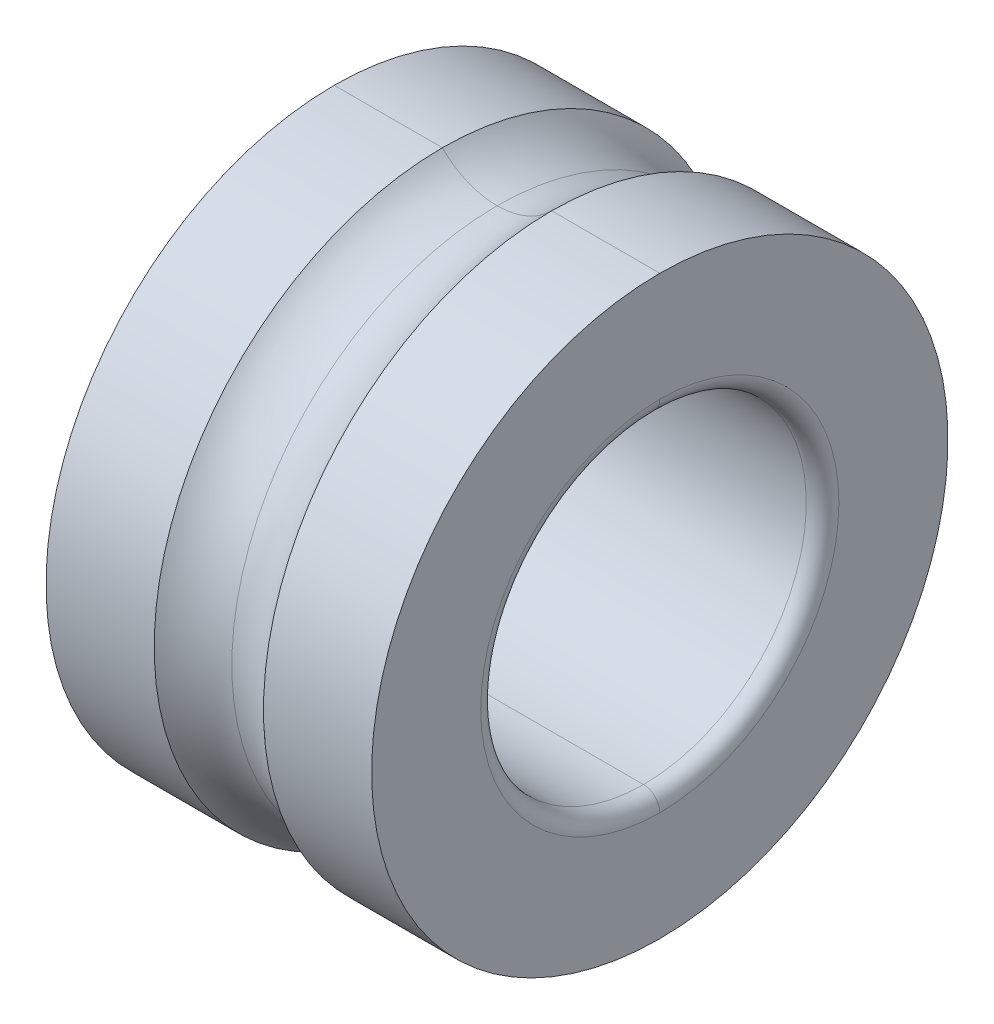
ISO-10303-21;
HEADER;
FILE_DESCRIPTION(('STEP AP214'),'2;1');
FILE_NAME('part.step','',(''),(''),'','','');
FILE_SCHEMA(('AUTOMOTIVE_DESIGN { 1 0 10303 214 1 1 1 1 }'));
ENDSEC;
DATA;
#1=APPLICATION_CONTEXT('core data for automotive mechanical design processes');
#2=APPLICATION_PROTOCOL_DEFINITION('international standard','automotive_design',2000,#1);
#3=PRODUCT_CONTEXT('',#1,'mechanical');
#4=PRODUCT('Part','Part','',(#3));
#5=PRODUCT_RELATED_PRODUCT_CATEGORY('part','',(#4));
#6=PRODUCT_DEFINITION_FORMATION('','',#4);
#7=PRODUCT_DEFINITION_CONTEXT('part definition',#1,'design');
#8=PRODUCT_DEFINITION('design','',#6,#7);
#9=PRODUCT_DEFINITION_SHAPE('','',#8);
#10=(LENGTH_UNIT() NAMED_UNIT(*) SI_UNIT(.MILLI.,.METRE.));
#11=(NAMED_UNIT(*) PLANE_ANGLE_UNIT() SI_UNIT($,.RADIAN.));
#12=(NAMED_UNIT(*) SI_UNIT($,.STERADIAN.) SOLID_ANGLE_UNIT());
#13=UNCERTAINTY_MEASURE_WITH_UNIT(LENGTH_MEASURE(1.E-05),#10,'distance_accuracy_value','');
#14=(GEOMETRIC_REPRESENTATION_CONTEXT(3) GLOBAL_UNCERTAINTY_ASSIGNED_CONTEXT((#13)) GLOBAL_UNIT_ASSIGNED_CONTEXT((#10,
#11,#12)) REPRESENTATION_CONTEXT('',''));
#15=CARTESIAN_POINT('',(0.,0.,0.));
#16=DIRECTION('',(0.,0.,1.));
#17=DIRECTION('',(1.,0.,0.));
#18=AXIS2_PLACEMENT_3D('',#15,#16,#17);
#19=CARTESIAN_POINT('',(-2.25171,0.,0.));
#20=DIRECTION('',(1.,0.,0.));
#21=DIRECTION('',(0.,-1.,0.));
#22=AXIS2_PLACEMENT_3D('',#19,#20,#21);
#23=TOROIDAL_SURFACE('',#22,2.75209,0.25019);
#24=CARTESIAN_POINT('',(-2.5019,0.,0.));
#25=DIRECTION('',(-1.,0.,0.));
#26=DIRECTION('',(0.,1.,0.));
#27=AXIS2_PLACEMENT_3D('',#24,#25,#26);
#28=CIRCLE('',#27,2.75209);
#29=CARTESIAN_POINT('',(-2.5019,2.75209,0.));
#30=VERTEX_POINT('',#29);
#31=CARTESIAN_POINT('',(-2.5019,-2.75209,0.));
#32=VERTEX_POINT('',#31);
#33=EDGE_CURVE('E197',#30,#32,#28,.T.);
#34=ORIENTED_EDGE('',*,*,#33,.T.);
#35=CARTESIAN_POINT('',(-2.25171,-2.75209,0.));
#36=DIRECTION('',(0.,0.,-1.));
#37=DIRECTION('',(-1.,0.,0.));
#38=AXIS2_PLACEMENT_3D('',#35,#36,#37);
#39=CIRCLE('',#38,0.25019);
#40=CARTESIAN_POINT('',(-2.25171,-2.5019,0.));
#41=VERTEX_POINT('',#40);
#42=EDGE_CURVE('E27',#32,#41,#39,.T.);
#43=ORIENTED_EDGE('',*,*,#42,.T.);
#44=CARTESIAN_POINT('',(-2.25171,0.,0.));
#45=DIRECTION('',(-1.,0.,0.));
#46=DIRECTION('',(0.,1.,0.));
#47=AXIS2_PLACEMENT_3D('',#44,#45,#46);
#48=CIRCLE('',#47,2.5019);
#49=CARTESIAN_POINT('',(-2.25171,2.5019,0.));
#50=VERTEX_POINT('',#49);
#51=EDGE_CURVE('E164',#50,#41,#48,.T.);
#52=ORIENTED_EDGE('',*,*,#51,.F.);
#53=CARTESIAN_POINT('',(-2.25171,2.75209,0.));
#54=DIRECTION('',(0.,0.,1.));
#55=DIRECTION('',(-1.,0.,0.));
#56=AXIS2_PLACEMENT_3D('',#53,#54,#55);
#57=CIRCLE('',#56,0.25019);
#58=EDGE_CURVE('E11',#30,#50,#57,.T.);
#59=ORIENTED_EDGE('',*,*,#58,.F.);
#60=EDGE_LOOP('',(#34,#43,#52,#59));
#61=FACE_BOUND('',#60,.T.);
#62=ADVANCED_FACE('F16',(#61),#23,.T.);
#63=CARTESIAN_POINT('',(-2.25171,0.,0.));
#64=DIRECTION('',(1.,0.,0.));
#65=DIRECTION('',(0.,-1.,0.));
#66=AXIS2_PLACEMENT_3D('',#63,#64,#65);
#67=TOROIDAL_SURFACE('',#66,2.75209,0.25019);
#68=CARTESIAN_POINT('',(-2.25171,0.,0.));
#69=DIRECTION('',(1.,0.,0.));
#70=DIRECTION('',(0.,1.,0.));
#71=AXIS2_PLACEMENT_3D('',#68,#69,#70);
#72=CIRCLE('',#71,2.5019);
#73=EDGE_CURVE('E200',#50,#41,#72,.T.);
#74=ORIENTED_EDGE('',*,*,#73,.T.);
#75=ORIENTED_EDGE('',*,*,#42,.F.);
#76=CARTESIAN_POINT('',(-2.5019,0.,0.));
#77=DIRECTION('',(1.,0.,0.));
#78=DIRECTION('',(0.,1.,0.));
#79=AXIS2_PLACEMENT_3D('',#76,#77,#78);
#80=CIRCLE('',#79,2.75209);
#81=EDGE_CURVE('E216',#30,#32,#80,.T.);
#82=ORIENTED_EDGE('',*,*,#81,.F.);
#83=ORIENTED_EDGE('',*,*,#58,.T.);
#84=EDGE_LOOP('',(#74,#75,#82,#83));
#85=FACE_BOUND('',#84,.T.);
#86=ADVANCED_FACE('F293',(#85),#67,.T.);
#87=CARTESIAN_POINT('',(-2.5019,0.,0.));
#88=DIRECTION('',(1.,0.,0.));
#89=DIRECTION('',(0.,1.,0.));
#90=AXIS2_PLACEMENT_3D('',#87,#88,#89);
#91=PLANE('',#90);
#92=ORIENTED_EDGE('',*,*,#33,.F.);
#93=ORIENTED_EDGE('',*,*,#81,.T.);
#94=EDGE_LOOP('',(#92,#93));
#95=FACE_BOUND('',#94,.T.);
#96=CARTESIAN_POINT('',(-2.5019,0.,0.));
#97=DIRECTION('',(1.,0.,0.));
#98=DIRECTION('',(0.,1.,0.));
#99=AXIS2_PLACEMENT_3D('',#96,#97,#98);
#100=CIRCLE('',#99,4.4283249);
#101=CARTESIAN_POINT('',(-2.5019,4.4283249,0.));
#102=VERTEX_POINT('',#101);
#103=CARTESIAN_POINT('',(-2.5019,-4.4283249,0.));
#104=VERTEX_POINT('',#103);
#105=EDGE_CURVE('E109',#102,#104,#100,.T.);
#106=ORIENTED_EDGE('',*,*,#105,.F.);
#107=CARTESIAN_POINT('',(-2.5019,0.,0.));
#108=DIRECTION('',(-1.,0.,0.));
#109=DIRECTION('',(0.,1.,0.));
#110=AXIS2_PLACEMENT_3D('',#107,#108,#109);
#111=CIRCLE('',#110,4.4283249);
#112=EDGE_CURVE('E193',#102,#104,#111,.T.);
#113=ORIENTED_EDGE('',*,*,#112,.T.);
#114=EDGE_LOOP('',(#106,#113));
#115=FACE_BOUND('',#114,.T.);
#116=ADVANCED_FACE('F288',(#95,#115),#91,.F.);
#117=CARTESIAN_POINT('',(-2.75209,0.,0.));
#118=DIRECTION('',(1.,0.,0.));
#119=DIRECTION('',(0.,-1.,0.));
#120=AXIS2_PLACEMENT_3D('',#117,#118,#119);
#121=CYLINDRICAL_SURFACE('',#120,4.4283249);
#122=CARTESIAN_POINT('',(-0.839755569912454,0.,0.));
#123=DIRECTION('',(-1.,0.,0.));
#124=DIRECTION('',(0.,1.,0.));
#125=AXIS2_PLACEMENT_3D('',#122,#123,#124);
#126=CIRCLE('',#125,4.4283249);
#127=CARTESIAN_POINT('',(-0.839755569912454,4.4283249,0.));
#128=VERTEX_POINT('',#127);
#129=CARTESIAN_POINT('',(-0.839755569912454,-4.4283249,0.));
#130=VERTEX_POINT('',#129);
#131=EDGE_CURVE('E127',#128,#130,#126,.T.);
#132=ORIENTED_EDGE('',*,*,#131,.T.);
#133=DIRECTION('',(-1.,0.,0.));
#134=VECTOR('',#133,1.);
#135=CARTESIAN_POINT('',(-0.839755569912453,-4.4283249,0.));
#136=LINE('',#135,#134);
#137=EDGE_CURVE('E102',#130,#104,#136,.T.);
#138=ORIENTED_EDGE('',*,*,#137,.T.);
#139=ORIENTED_EDGE('',*,*,#112,.F.);
#140=DIRECTION('',(-1.,0.,0.));
#141=VECTOR('',#140,1.);
#142=CARTESIAN_POINT('',(-0.839755569912453,4.4283249,0.));
#143=LINE('',#142,#141);
#144=EDGE_CURVE('E114',#128,#102,#143,.T.);
#145=ORIENTED_EDGE('',*,*,#144,.F.);
#146=EDGE_LOOP('',(#132,#138,#139,#145));
#147=FACE_BOUND('',#146,.T.);
#148=ADVANCED_FACE('F128',(#147),#121,.T.);
#149=CARTESIAN_POINT('',(-2.75209,0.,0.));
#150=DIRECTION('',(1.,0.,0.));
#151=DIRECTION('',(0.,-1.,0.));
#152=AXIS2_PLACEMENT_3D('',#149,#150,#151);
#153=CYLINDRICAL_SURFACE('',#152,4.4283249);
#154=ORIENTED_EDGE('',*,*,#105,.T.);
#155=ORIENTED_EDGE('',*,*,#137,.F.);
#156=CARTESIAN_POINT('',(-0.839755569912454,0.,0.));
#157=DIRECTION('',(1.,0.,0.));
#158=DIRECTION('',(0.,1.,0.));
#159=AXIS2_PLACEMENT_3D('',#156,#157,#158);
#160=CIRCLE('',#159,4.4283249);
#161=EDGE_CURVE('E106',#128,#130,#160,.T.);
#162=ORIENTED_EDGE('',*,*,#161,.F.);
#163=ORIENTED_EDGE('',*,*,#144,.T.);
#164=EDGE_LOOP('',(#154,#155,#162,#163));
#165=FACE_BOUND('',#164,.T.);
#166=ADVANCED_FACE('F104',(#165),#153,.T.);
#167=CARTESIAN_POINT('',(0.,0.,0.));
#168=DIRECTION('',(1.,0.,0.));
#169=DIRECTION('',(0.,-1.,0.));
#170=AXIS2_PLACEMENT_3D('',#167,#168,#169);
#171=TOROIDAL_SURFACE('',#170,5.25145,1.175893);
#172=CARTESIAN_POINT('',(0.,0.,0.));
#173=DIRECTION('',(1.,0.,0.));
#174=DIRECTION('',(0.,0.,-1.));
#175=AXIS2_PLACEMENT_3D('',#172,#173,#174);
#176=CIRCLE('',#175,4.075557);
#177=CARTESIAN_POINT('',(0.,4.075557,0.));
#178=VERTEX_POINT('',#177);
#179=CARTESIAN_POINT('',(0.,-4.075557,0.));
#180=VERTEX_POINT('',#179);
#181=EDGE_CURVE('E183',#178,#180,#176,.T.);
#182=ORIENTED_EDGE('',*,*,#181,.F.);
#183=CARTESIAN_POINT('',(0.,5.25145,0.));
#184=DIRECTION('',(0.,0.,-1.));
#185=DIRECTION('',(0.714142842854285,-0.7,0.));
#186=AXIS2_PLACEMENT_3D('',#183,#184,#185);
#187=CIRCLE('',#186,1.175893);
#188=EDGE_CURVE('E123',#178,#128,#187,.T.);
#189=ORIENTED_EDGE('',*,*,#188,.T.);
#190=ORIENTED_EDGE('',*,*,#161,.T.);
#191=CARTESIAN_POINT('',(0.,-5.25145,0.));
#192=DIRECTION('',(0.,0.,1.));
#193=DIRECTION('',(0.714142842854285,0.7,0.));
#194=AXIS2_PLACEMENT_3D('',#191,#192,#193);
#195=CIRCLE('',#194,1.175893);
#196=EDGE_CURVE('E121',#180,#130,#195,.T.);
#197=ORIENTED_EDGE('',*,*,#196,.F.);
#198=EDGE_LOOP('',(#182,#189,#190,#197));
#199=FACE_BOUND('',#198,.T.);
#200=ADVANCED_FACE('F119',(#199),#171,.F.);
#201=CARTESIAN_POINT('',(0.,0.,0.));
#202=DIRECTION('',(1.,0.,0.));
#203=DIRECTION('',(0.,-1.,0.));
#204=AXIS2_PLACEMENT_3D('',#201,#202,#203);
#205=TOROIDAL_SURFACE('',#204,5.25145,1.175893);
#206=CARTESIAN_POINT('',(0.,0.,0.));
#207=DIRECTION('',(1.,0.,0.));
#208=DIRECTION('',(0.,0.,-1.));
#209=AXIS2_PLACEMENT_3D('',#206,#207,#208);
#210=CIRCLE('',#209,4.075557);
#211=EDGE_CURVE('E134',#180,#178,#210,.T.);
#212=ORIENTED_EDGE('',*,*,#211,.F.);
#213=ORIENTED_EDGE('',*,*,#196,.T.);
#214=ORIENTED_EDGE('',*,*,#131,.F.);
#215=ORIENTED_EDGE('',*,*,#188,.F.);
#216=EDGE_LOOP('',(#212,#213,#214,#215));
#217=FACE_BOUND('',#216,.T.);
#218=ADVANCED_FACE('F132',(#217),#205,.F.);
#219=CARTESIAN_POINT('',(-2.75209,0.,0.));
#220=DIRECTION('',(1.,0.,0.));
#221=DIRECTION('',(0.,-1.,0.));
#222=AXIS2_PLACEMENT_3D('',#219,#220,#221);
#223=CYLINDRICAL_SURFACE('',#222,4.4283249);
#224=CARTESIAN_POINT('',(2.5019,0.,0.));
#225=DIRECTION('',(-1.,0.,0.));
#226=DIRECTION('',(0.,1.,0.));
#227=AXIS2_PLACEMENT_3D('',#224,#225,#226);
#228=CIRCLE('',#227,4.4283249);
#229=CARTESIAN_POINT('',(2.5019,4.4283249,0.));
#230=VERTEX_POINT('',#229);
#231=CARTESIAN_POINT('',(2.5019,-4.4283249,0.));
#232=VERTEX_POINT('',#231);
#233=EDGE_CURVE('E190',#230,#232,#228,.T.);
#234=ORIENTED_EDGE('',*,*,#233,.T.);
#235=DIRECTION('',(-1.,0.,0.));
#236=VECTOR('',#235,1.);
#237=CARTESIAN_POINT('',(2.5019,-4.4283249,0.));
#238=LINE('',#237,#236);
#239=CARTESIAN_POINT('',(0.839755569912454,-4.4283249,0.));
#240=VERTEX_POINT('',#239);
#241=EDGE_CURVE('E144',#232,#240,#238,.T.);
#242=ORIENTED_EDGE('',*,*,#241,.T.);
#243=CARTESIAN_POINT('',(0.839755569912454,0.,0.));
#244=DIRECTION('',(-1.,0.,0.));
#245=DIRECTION('',(0.,1.,0.));
#246=AXIS2_PLACEMENT_3D('',#243,#244,#245);
#247=CIRCLE('',#246,4.4283249);
#248=CARTESIAN_POINT('',(0.839755569912454,4.4283249,0.));
#249=VERTEX_POINT('',#248);
#250=EDGE_CURVE('E172',#249,#240,#247,.T.);
#251=ORIENTED_EDGE('',*,*,#250,.F.);
#252=DIRECTION('',(-1.,0.,0.));
#253=VECTOR('',#252,1.);
#254=CARTESIAN_POINT('',(2.5019,4.4283249,0.));
#255=LINE('',#254,#253);
#256=EDGE_CURVE('E137',#230,#249,#255,.T.);
#257=ORIENTED_EDGE('',*,*,#256,.F.);
#258=EDGE_LOOP('',(#234,#242,#251,#257));
#259=FACE_BOUND('',#258,.T.);
#260=ADVANCED_FACE('F240',(#259),#223,.T.);
#261=CARTESIAN_POINT('',(-2.75209,0.,0.));
#262=DIRECTION('',(1.,0.,0.));
#263=DIRECTION('',(0.,-1.,0.));
#264=AXIS2_PLACEMENT_3D('',#261,#262,#263);
#265=CYLINDRICAL_SURFACE('',#264,4.4283249);
#266=CARTESIAN_POINT('',(0.839755569912454,0.,0.));
#267=DIRECTION('',(1.,0.,0.));
#268=DIRECTION('',(0.,1.,0.));
#269=AXIS2_PLACEMENT_3D('',#266,#267,#268);
#270=CIRCLE('',#269,4.4283249);
#271=EDGE_CURVE('E175',#249,#240,#270,.T.);
#272=ORIENTED_EDGE('',*,*,#271,.T.);
#273=ORIENTED_EDGE('',*,*,#241,.F.);
#274=CARTESIAN_POINT('',(2.5019,0.,0.));
#275=DIRECTION('',(1.,0.,0.));
#276=DIRECTION('',(0.,1.,0.));
#277=AXIS2_PLACEMENT_3D('',#274,#275,#276);
#278=CIRCLE('',#277,4.4283249);
#279=EDGE_CURVE('E212',#230,#232,#278,.T.);
#280=ORIENTED_EDGE('',*,*,#279,.F.);
#281=ORIENTED_EDGE('',*,*,#256,.T.);
#282=EDGE_LOOP('',(#272,#273,#280,#281));
#283=FACE_BOUND('',#282,.T.);
#284=ADVANCED_FACE('F249',(#283),#265,.T.);
#285=CARTESIAN_POINT('',(2.5019,0.,0.));
#286=DIRECTION('',(1.,0.,0.));
#287=DIRECTION('',(0.,1.,0.));
#288=AXIS2_PLACEMENT_3D('',#285,#286,#287);
#289=PLANE('',#288);
#290=CARTESIAN_POINT('',(2.5019,0.,0.));
#291=DIRECTION('',(1.,0.,0.));
#292=DIRECTION('',(0.,1.,0.));
#293=AXIS2_PLACEMENT_3D('',#290,#291,#292);
#294=CIRCLE('',#293,2.75209);
#295=CARTESIAN_POINT('',(2.5019,2.75209,0.));
#296=VERTEX_POINT('',#295);
#297=CARTESIAN_POINT('',(2.5019,-2.75209,0.));
#298=VERTEX_POINT('',#297);
#299=EDGE_CURVE('E203',#296,#298,#294,.T.);
#300=ORIENTED_EDGE('',*,*,#299,.F.);
#301=CARTESIAN_POINT('',(2.5019,0.,0.));
#302=DIRECTION('',(-1.,0.,0.));
#303=DIRECTION('',(0.,1.,0.));
#304=AXIS2_PLACEMENT_3D('',#301,#302,#303);
#305=CIRCLE('',#304,2.75209);
#306=EDGE_CURVE('E188',#296,#298,#305,.T.);
#307=ORIENTED_EDGE('',*,*,#306,.T.);
#308=EDGE_LOOP('',(#300,#307));
#309=FACE_BOUND('',#308,.T.);
#310=ORIENTED_EDGE('',*,*,#233,.F.);
#311=ORIENTED_EDGE('',*,*,#279,.T.);
#312=EDGE_LOOP('',(#310,#311));
#313=FACE_BOUND('',#312,.T.);
#314=ADVANCED_FACE('F330',(#309,#313),#289,.T.);
#315=CARTESIAN_POINT('',(2.25171,0.,0.));
#316=DIRECTION('',(1.,0.,0.));
#317=DIRECTION('',(0.,-1.,0.));
#318=AXIS2_PLACEMENT_3D('',#315,#316,#317);
#319=TOROIDAL_SURFACE('',#318,2.75209,0.25019);
#320=CARTESIAN_POINT('',(2.25171,0.,0.));
#321=DIRECTION('',(-1.,0.,0.));
#322=DIRECTION('',(0.,1.,0.));
#323=AXIS2_PLACEMENT_3D('',#320,#321,#322);
#324=CIRCLE('',#323,2.5019);
#325=CARTESIAN_POINT('',(2.25171,2.5019,0.));
#326=VERTEX_POINT('',#325);
#327=CARTESIAN_POINT('',(2.25171,-2.5019,0.));
#328=VERTEX_POINT('',#327);
#329=EDGE_CURVE('E149',#326,#328,#324,.T.);
#330=ORIENTED_EDGE('',*,*,#329,.T.);
#331=CARTESIAN_POINT('',(2.25171,-2.75209,0.));
#332=DIRECTION('',(0.,0.,-1.));
#333=DIRECTION('',(0.,1.,0.));
#334=AXIS2_PLACEMENT_3D('',#331,#332,#333);
#335=CIRCLE('',#334,0.25019);
#336=EDGE_CURVE('E20',#328,#298,#335,.T.);
#337=ORIENTED_EDGE('',*,*,#336,.T.);
#338=ORIENTED_EDGE('',*,*,#306,.F.);
#339=CARTESIAN_POINT('',(2.25171,2.75209,0.));
#340=DIRECTION('',(0.,0.,1.));
#341=DIRECTION('',(0.,-1.,0.));
#342=AXIS2_PLACEMENT_3D('',#339,#340,#341);
#343=CIRCLE('',#342,0.25019);
#344=EDGE_CURVE('E191',#326,#296,#343,.T.);
#345=ORIENTED_EDGE('',*,*,#344,.F.);
#346=EDGE_LOOP('',(#330,#337,#338,#345));
#347=FACE_BOUND('',#346,.T.);
#348=ADVANCED_FACE('F335',(#347),#319,.T.);
#349=CARTESIAN_POINT('',(2.25171,0.,0.));
#350=DIRECTION('',(1.,0.,0.));
#351=DIRECTION('',(0.,-1.,0.));
#352=AXIS2_PLACEMENT_3D('',#349,#350,#351);
#353=TOROIDAL_SURFACE('',#352,2.75209,0.25019);
#354=ORIENTED_EDGE('',*,*,#299,.T.);
#355=ORIENTED_EDGE('',*,*,#336,.F.);
#356=CARTESIAN_POINT('',(2.25171,0.,0.));
#357=DIRECTION('',(1.,0.,0.));
#358=DIRECTION('',(0.,1.,0.));
#359=AXIS2_PLACEMENT_3D('',#356,#357,#358);
#360=CIRCLE('',#359,2.5019);
#361=EDGE_CURVE('E147',#326,#328,#360,.T.);
#362=ORIENTED_EDGE('',*,*,#361,.F.);
#363=ORIENTED_EDGE('',*,*,#344,.T.);
#364=EDGE_LOOP('',(#354,#355,#362,#363));
#365=FACE_BOUND('',#364,.T.);
#366=ADVANCED_FACE('F381',(#365),#353,.T.);
#367=CARTESIAN_POINT('',(-2.75209,0.,0.));
#368=DIRECTION('',(1.,0.,0.));
#369=DIRECTION('',(0.,-1.,0.));
#370=AXIS2_PLACEMENT_3D('',#367,#368,#369);
#371=CYLINDRICAL_SURFACE('',#370,2.5019);
#372=ORIENTED_EDGE('',*,*,#361,.T.);
#373=DIRECTION('',(1.,0.,0.));
#374=VECTOR('',#373,1.);
#375=CARTESIAN_POINT('',(-2.25171,-2.5019,0.));
#376=LINE('',#375,#374);
#377=EDGE_CURVE('E153',#41,#328,#376,.T.);
#378=ORIENTED_EDGE('',*,*,#377,.F.);
#379=ORIENTED_EDGE('',*,*,#73,.F.);
#380=DIRECTION('',(1.,0.,0.));
#381=VECTOR('',#380,1.);
#382=CARTESIAN_POINT('',(-2.25171,2.5019,0.));
#383=LINE('',#382,#381);
#384=EDGE_CURVE('E152',#50,#326,#383,.T.);
#385=ORIENTED_EDGE('',*,*,#384,.T.);
#386=EDGE_LOOP('',(#372,#378,#379,#385));
#387=FACE_BOUND('',#386,.T.);
#388=ADVANCED_FACE('F273',(#387),#371,.F.);
#389=CARTESIAN_POINT('',(-2.75209,0.,0.));
#390=DIRECTION('',(1.,0.,0.));
#391=DIRECTION('',(0.,-1.,0.));
#392=AXIS2_PLACEMENT_3D('',#389,#390,#391);
#393=CYLINDRICAL_SURFACE('',#392,2.5019);
#394=ORIENTED_EDGE('',*,*,#51,.T.);
#395=ORIENTED_EDGE('',*,*,#377,.T.);
#396=ORIENTED_EDGE('',*,*,#329,.F.);
#397=ORIENTED_EDGE('',*,*,#384,.F.);
#398=EDGE_LOOP('',(#394,#395,#396,#397));
#399=FACE_BOUND('',#398,.T.);
#400=ADVANCED_FACE('F18',(#399),#393,.F.);
#401=CARTESIAN_POINT('',(0.,0.,0.));
#402=DIRECTION('',(1.,0.,0.));
#403=DIRECTION('',(0.,-1.,0.));
#404=AXIS2_PLACEMENT_3D('',#401,#402,#403);
#405=TOROIDAL_SURFACE('',#404,5.25145,1.175893);
#406=CARTESIAN_POINT('',(0.,-5.25145,0.));
#407=DIRECTION('',(0.,0.,1.));
#408=DIRECTION('',(0.714142842854285,0.7,0.));
#409=AXIS2_PLACEMENT_3D('',#406,#407,#408);
#410=CIRCLE('',#409,1.175893);
#411=EDGE_CURVE('E179',#240,#180,#410,.T.);
#412=ORIENTED_EDGE('',*,*,#411,.T.);
#413=ORIENTED_EDGE('',*,*,#211,.T.);
#414=CARTESIAN_POINT('',(0.,5.25145,0.));
#415=DIRECTION('',(0.,0.,-1.));
#416=DIRECTION('',(0.714142842854285,-0.7,0.));
#417=AXIS2_PLACEMENT_3D('',#414,#415,#416);
#418=CIRCLE('',#417,1.175893);
#419=EDGE_CURVE('E186',#249,#178,#418,.T.);
#420=ORIENTED_EDGE('',*,*,#419,.F.);
#421=ORIENTED_EDGE('',*,*,#250,.T.);
#422=EDGE_LOOP('',(#412,#413,#420,#421));
#423=FACE_BOUND('',#422,.T.);
#424=ADVANCED_FACE('F247',(#423),#405,.F.);
#425=CARTESIAN_POINT('',(0.,0.,0.));
#426=DIRECTION('',(1.,0.,0.));
#427=DIRECTION('',(0.,-1.,0.));
#428=AXIS2_PLACEMENT_3D('',#425,#426,#427);
#429=TOROIDAL_SURFACE('',#428,5.25145,1.175893);
#430=ORIENTED_EDGE('',*,*,#419,.T.);
#431=ORIENTED_EDGE('',*,*,#181,.T.);
#432=ORIENTED_EDGE('',*,*,#411,.F.);
#433=ORIENTED_EDGE('',*,*,#271,.F.);
#434=EDGE_LOOP('',(#430,#431,#432,#433));
#435=FACE_BOUND('',#434,.T.);
#436=ADVANCED_FACE('F251',(#435),#429,.F.);
#437=CLOSED_SHELL('',(#62,#86,#116,#148,#166,#200,#218,#260,#284,#314,#348,#366,#388,#400,#424,#436));
#438=MANIFOLD_SOLID_BREP('B1',#437);
#439=ADVANCED_BREP_SHAPE_REPRESENTATION('',(#18,#438),#14);
#440=SHAPE_DEFINITION_REPRESENTATION(#9,#439);
ENDSEC;
END-ISO-10303-21;
